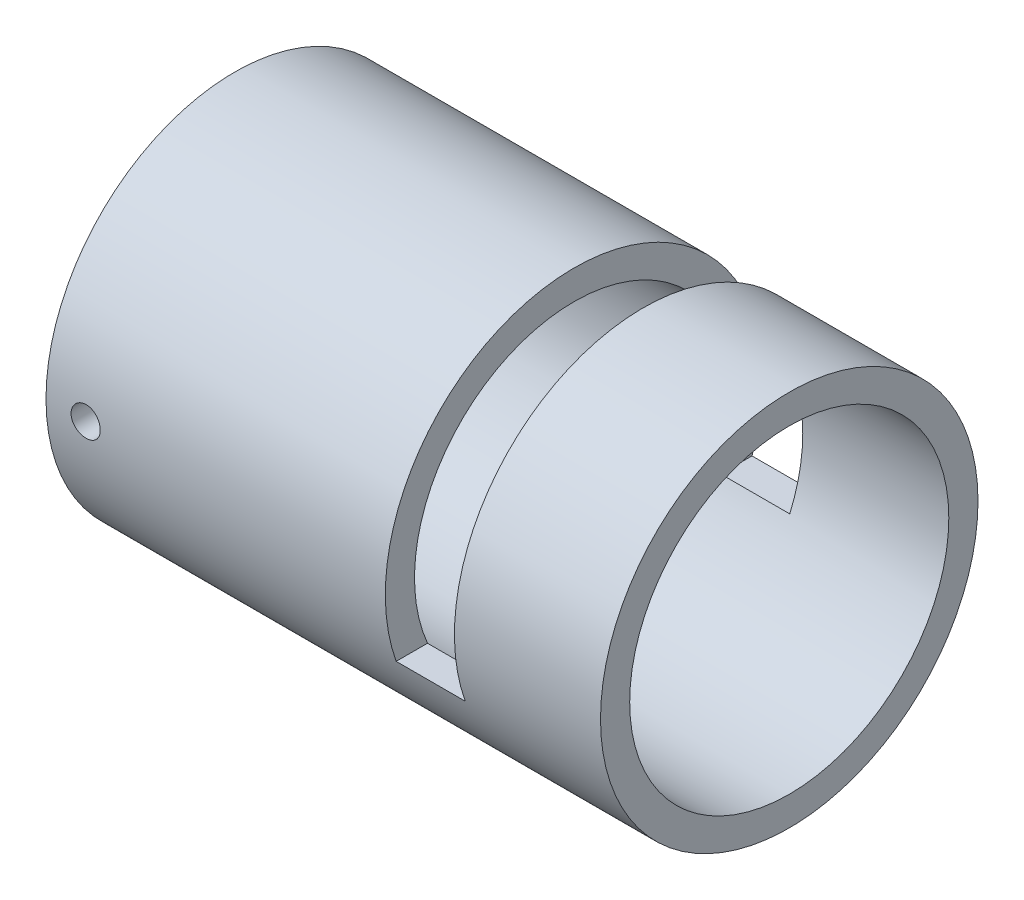
ISO-10303-21;
HEADER;
FILE_DESCRIPTION(('STEP AP214'),'2;1');
FILE_NAME('part.step','',(''),(''),'','','');
FILE_SCHEMA(('AUTOMOTIVE_DESIGN { 1 0 10303 214 1 1 1 1 }'));
ENDSEC;
DATA;
#1=APPLICATION_CONTEXT('core data for automotive mechanical design processes');
#2=APPLICATION_PROTOCOL_DEFINITION('international standard','automotive_design',2000,#1);
#3=PRODUCT_CONTEXT('',#1,'mechanical');
#4=PRODUCT('Part','Part','',(#3));
#5=PRODUCT_RELATED_PRODUCT_CATEGORY('part','',(#4));
#6=PRODUCT_DEFINITION_FORMATION('','',#4);
#7=PRODUCT_DEFINITION_CONTEXT('part definition',#1,'design');
#8=PRODUCT_DEFINITION('design','',#6,#7);
#9=PRODUCT_DEFINITION_SHAPE('','',#8);
#10=(LENGTH_UNIT() NAMED_UNIT(*) SI_UNIT(.MILLI.,.METRE.));
#11=(NAMED_UNIT(*) PLANE_ANGLE_UNIT() SI_UNIT($,.RADIAN.));
#12=(NAMED_UNIT(*) SI_UNIT($,.STERADIAN.) SOLID_ANGLE_UNIT());
#13=UNCERTAINTY_MEASURE_WITH_UNIT(LENGTH_MEASURE(1.E-05),#10,'distance_accuracy_value','');
#14=(GEOMETRIC_REPRESENTATION_CONTEXT(3) GLOBAL_UNCERTAINTY_ASSIGNED_CONTEXT((#13)) GLOBAL_UNIT_ASSIGNED_CONTEXT((#10,
#11,#12)) REPRESENTATION_CONTEXT('',''));
#15=CARTESIAN_POINT('',(0.,0.,0.));
#16=DIRECTION('',(0.,0.,1.));
#17=DIRECTION('',(1.,0.,0.));
#18=AXIS2_PLACEMENT_3D('',#15,#16,#17);
#19=CARTESIAN_POINT('',(-76.,0.,0.));
#20=DIRECTION('',(1.,0.,0.));
#21=DIRECTION('',(0.,0.,-1.));
#22=AXIS2_PLACEMENT_3D('',#19,#20,#21);
#23=CYLINDRICAL_SURFACE('',#22,25.8690409108859);
#24=CARTESIAN_POINT('',(0.,0.,0.));
#25=DIRECTION('',(1.,0.,0.));
#26=DIRECTION('',(0.,0.,-1.));
#27=AXIS2_PLACEMENT_3D('',#24,#25,#26);
#28=CIRCLE('',#27,25.8690409108859);
#29=CARTESIAN_POINT('',(0.,0.,-25.8690409108859));
#30=VERTEX_POINT('',#29);
#31=EDGE_CURVE('E93',#30,#30,#28,.T.);
#32=ORIENTED_EDGE('',*,*,#31,.F.);
#33=EDGE_LOOP('',(#32));
#34=FACE_BOUND('',#33,.T.);
#35=CARTESIAN_POINT('',(-76.,0.,0.));
#36=DIRECTION('',(1.,0.,0.));
#37=DIRECTION('',(0.,0.,-1.));
#38=AXIS2_PLACEMENT_3D('',#35,#36,#37);
#39=CIRCLE('',#38,25.8690409108859);
#40=CARTESIAN_POINT('',(-76.,0.,-25.8690409108859));
#41=VERTEX_POINT('',#40);
#42=EDGE_CURVE('E78',#41,#41,#39,.T.);
#43=ORIENTED_EDGE('',*,*,#42,.T.);
#44=EDGE_LOOP('',(#43));
#45=FACE_BOUND('',#44,.T.);
#46=CARTESIAN_POINT('',(-20.0182432156763,0.,0.));
#47=DIRECTION('',(1.,0.,0.));
#48=DIRECTION('',(0.,1.,0.));
#49=AXIS2_PLACEMENT_3D('',#46,#47,#48);
#50=CIRCLE('',#49,25.8690409108859);
#51=CARTESIAN_POINT('',(-20.0182432156763,-8.63877637101188,24.3839869681054));
#52=VERTEX_POINT('',#51);
#53=CARTESIAN_POINT('',(-20.0182432156763,-8.63877637101188,-24.3839869681054));
#54=VERTEX_POINT('',#53);
#55=EDGE_CURVE('E102',#52,#54,#50,.F.);
#56=ORIENTED_EDGE('',*,*,#55,.F.);
#57=DIRECTION('',(1.,0.,0.));
#58=VECTOR('',#57,1.);
#59=CARTESIAN_POINT('',(-76.,-8.63877637101188,24.3839869681054));
#60=LINE('',#59,#58);
#61=CARTESIAN_POINT('',(-29.4907377006783,-8.63877637101188,24.3839869681054));
#62=VERTEX_POINT('',#61);
#63=EDGE_CURVE('E107',#62,#52,#60,.T.);
#64=ORIENTED_EDGE('',*,*,#63,.F.);
#65=CARTESIAN_POINT('',(-29.4907377006783,0.,0.));
#66=DIRECTION('',(-1.,0.,0.));
#67=DIRECTION('',(0.,0.,1.));
#68=AXIS2_PLACEMENT_3D('',#65,#66,#67);
#69=CIRCLE('',#68,25.8690409108859);
#70=CARTESIAN_POINT('',(-29.4907377006783,-8.63877637101188,-24.3839869681054));
#71=VERTEX_POINT('',#70);
#72=EDGE_CURVE('E109',#71,#62,#69,.F.);
#73=ORIENTED_EDGE('',*,*,#72,.F.);
#74=DIRECTION('',(1.,0.,0.));
#75=VECTOR('',#74,1.);
#76=CARTESIAN_POINT('',(-76.,-8.63877637101188,-24.3839869681054));
#77=LINE('',#76,#75);
#78=EDGE_CURVE('E85',#54,#71,#77,.F.);
#79=ORIENTED_EDGE('',*,*,#78,.F.);
#80=EDGE_LOOP('',(#56,#64,#73,#79));
#81=FACE_BOUND('',#80,.T.);
#82=CARTESIAN_POINT('',(-72.5655206419493,0.,-25.8690409108859));
#83=CARTESIAN_POINT('',(-72.5655157309267,-0.1121611800042,-25.8690398931613));
#84=CARTESIAN_POINT('',(-72.5560538173916,-0.224399409221578,-25.8683036757847));
#85=CARTESIAN_POINT('',(-72.5184465726893,-0.445772452814454,-25.8654375416546));
#86=CARTESIAN_POINT('',(-72.4902798901789,-0.554903571812351,-25.8633060322261));
#87=CARTESIAN_POINT('',(-72.4160807328354,-0.766824046619074,-25.8578902677472));
#88=CARTESIAN_POINT('',(-72.3700581496239,-0.869616877170627,-25.8546066510251));
#89=CARTESIAN_POINT('',(-72.2614707882301,-1.06599315175739,-25.8472552536145));
#90=CARTESIAN_POINT('',(-72.1989096278436,-1.15957860376059,-25.8431876444762));
#91=CARTESIAN_POINT('',(-72.058870867979,-1.33511615635241,-25.8347148742354));
#92=CARTESIAN_POINT('',(-71.9813642537848,-1.41704508065181,-25.8303090667445));
#93=CARTESIAN_POINT('',(-71.8136956925462,-1.56674522133991,-25.8216619125487));
#94=CARTESIAN_POINT('',(-71.7235331986861,-1.63451582568261,-25.8174205729601));
#95=CARTESIAN_POINT('',(-71.5329740843417,-1.75405235353787,-25.8095754304018));
#96=CARTESIAN_POINT('',(-71.4325648184592,-1.80579817561972,-25.8059724305668));
#97=CARTESIAN_POINT('',(-71.2244506902607,-1.89168781694265,-25.7998189880917));
#98=CARTESIAN_POINT('',(-71.1167459407177,-1.92583190819954,-25.7972685291859));
#99=CARTESIAN_POINT('',(-70.897328368565,-1.97548232262893,-25.7935141538144));
#100=CARTESIAN_POINT('',(-70.785624062064,-1.99102607283211,-25.7923075336585));
#101=CARTESIAN_POINT('',(-70.5611858903497,-2.003150172866,-25.7913688256048));
#102=CARTESIAN_POINT('',(-70.4484520420462,-1.99973083359883,-25.7916367135323));
#103=CARTESIAN_POINT('',(-70.2254109032453,-1.97405678324625,-25.7936143044724));
#104=CARTESIAN_POINT('',(-70.1150989057892,-1.95184269055959,-25.7953208981883));
#105=CARTESIAN_POINT('',(-69.8997739681893,-1.88927278293266,-25.7999787184809));
#106=CARTESIAN_POINT('',(-69.7947610734718,-1.84891681250161,-25.8029299557251));
#107=CARTESIAN_POINT('',(-69.5928854849561,-1.75116302635236,-25.8097480965432));
#108=CARTESIAN_POINT('',(-69.4960316811968,-1.6937469226775,-25.8136159818313));
#109=CARTESIAN_POINT('',(-69.3133208048471,-1.5635159045951,-25.8218306559341));
#110=CARTESIAN_POINT('',(-69.2274639235175,-1.49070072242217,-25.8261774530756));
#111=CARTESIAN_POINT('',(-69.0689478324804,-1.33151038324341,-25.8348739786877));
#112=CARTESIAN_POINT('',(-68.9963238931217,-1.24510009939567,-25.83922368485));
#113=CARTESIAN_POINT('',(-68.8666077084133,-1.06129516248848,-25.8474249925234));
#114=CARTESIAN_POINT('',(-68.8095154716445,-0.9639005033605,-25.8512765937594));
#115=CARTESIAN_POINT('',(-68.7124857762371,-0.760869051817435,-25.8580482962047));
#116=CARTESIAN_POINT('',(-68.6725498077263,-0.655231544401361,-25.8609683164947));
#117=CARTESIAN_POINT('',(-68.6109906163078,-0.438723268815589,-25.8655468712195));
#118=CARTESIAN_POINT('',(-68.5893670662982,-0.327852594159693,-25.8672054281868));
#119=CARTESIAN_POINT('',(-68.5650905809609,-0.104331005835406,-25.8690712838992));
#120=CARTESIAN_POINT('',(-68.5623889131664,0.00831458527016643,-25.8692823106651));
#121=CARTESIAN_POINT('',(-68.5759053261401,0.232457169518035,-25.8682392724035));
#122=CARTESIAN_POINT('',(-68.5921232553403,0.343954171854649,-25.8669852191131));
#123=CARTESIAN_POINT('',(-68.6429781166276,0.562496169040388,-25.863155495715));
#124=CARTESIAN_POINT('',(-68.6775925334809,0.669546433895366,-25.8605814412754));
#125=CARTESIAN_POINT('',(-68.7642348398479,0.876319253048502,-25.8544010094354));
#126=CARTESIAN_POINT('',(-68.8162629673493,0.976041707177065,-25.8507946179266));
#127=CARTESIAN_POINT('',(-68.9363787797521,1.16555036918215,-25.8429447908862));
#128=CARTESIAN_POINT('',(-69.0044988329215,1.25531600742811,-25.8387000777328));
#129=CARTESIAN_POINT('',(-69.1548179487456,1.42215546447356,-25.8300550565032));
#130=CARTESIAN_POINT('',(-69.2370172220298,1.49922909336286,-25.8256547461001));
#131=CARTESIAN_POINT('',(-69.4133725285744,1.63866319704776,-25.8171835052501));
#132=CARTESIAN_POINT('',(-69.5075536980804,1.70099192965493,-25.8131132975845));
#133=CARTESIAN_POINT('',(-69.7050738437384,1.80894948213598,-25.8057729931572));
#134=CARTESIAN_POINT('',(-69.8084127394337,1.85457844871012,-25.802502889367));
#135=CARTESIAN_POINT('',(-70.0212014048842,1.92778687153344,-25.7971368686899));
#136=CARTESIAN_POINT('',(-70.1306443963118,1.95538593251642,-25.795039676801));
#137=CARTESIAN_POINT('',(-70.3526278060323,1.99181500194299,-25.792252512275));
#138=CARTESIAN_POINT('',(-70.4651681740101,2.00064531509223,-25.7915625167925));
#139=CARTESIAN_POINT('',(-70.6898362505237,1.9992829159535,-25.7916681376176));
#140=CARTESIAN_POINT('',(-70.8019642667571,1.9891400846402,-25.7924598584505));
#141=CARTESIAN_POINT('',(-71.022919497551,1.95022313958523,-25.7954314340034));
#142=CARTESIAN_POINT('',(-71.1317467067353,1.92144899549917,-25.797611290984));
#143=CARTESIAN_POINT('',(-71.3430156205925,1.8460984504445,-25.8031125105256));
#144=CARTESIAN_POINT('',(-71.4454575760609,1.79952274918566,-25.8064338282196));
#145=CARTESIAN_POINT('',(-71.6410758146042,1.68989706224039,-25.8138437765817));
#146=CARTESIAN_POINT('',(-71.734252273006,1.6268473883655,-25.8179323927263));
#147=CARTESIAN_POINT('',(-71.9089494368753,1.48587651122678,-25.8264289692107));
#148=CARTESIAN_POINT('',(-71.9904404388503,1.40791854510715,-25.8308377019073));
#149=CARTESIAN_POINT('',(-72.1392116020766,1.23940718620378,-25.8394707649629));
#150=CARTESIAN_POINT('',(-72.2064883081634,1.14885073987416,-25.8436950502895));
#151=CARTESIAN_POINT('',(-72.3249981501013,0.957561534118862,-25.8514898118666));
#152=CARTESIAN_POINT('',(-72.3762044758339,0.856812136162174,-25.8550591914654));
#153=CARTESIAN_POINT('',(-72.4609093943546,0.648188207251334,-25.8611286482198));
#154=CARTESIAN_POINT('',(-72.4944284644273,0.540322079202815,-25.863629961278));
#155=CARTESIAN_POINT('',(-72.5342147777892,0.359843279304291,-25.8666350613494));
#156=CARTESIAN_POINT('',(-72.5459390087628,0.288393277183435,-25.867533178977));
#157=CARTESIAN_POINT('',(-72.5615935157776,0.14463953115799,-25.8687364312631));
#158=CARTESIAN_POINT('',(-72.5655238092011,0.0723357891578036,-25.8690415672441));
#159=CARTESIAN_POINT('',(-72.5655206419493,0.,-25.8690409108859));
#160=B_SPLINE_CURVE_WITH_KNOTS('',3,(#82,#83,#84,#85,#86,#87,#88,#89,#90,#91,#92,#93,#94,#95,
#96,#97,#98,#99,#100,#101,#102,#103,#104,#105,#106,#107,#108,#109,#110,#111,#112,#113,#114,#115,
#116,#117,#118,#119,#120,#121,#122,#123,#124,#125,#126,#127,#128,#129,#130,#131,#132,#133,#134,
#135,#136,#137,#138,#139,#140,#141,#142,#143,#144,#145,#146,#147,#148,#149,#150,#151,#152,#153,
#154,#155,#156,#157,#158,#159),.UNSPECIFIED.,.T.,.F.,(4,2,2,2,2,2,2,2,2,2,2,2,2,2,2,2,2,2,2,2,2,
2,2,2,2,2,2,2,2,2,2,2,2,2,2,2,2,2,4),(0.,0.336219446995308,0.672823347008522,1.00924104441277,
1.34558521162153,1.6825890451,2.01960744380845,2.3570469006469,2.69448114256529,
3.03123526186383,3.36798386005459,3.70400654540794,4.04003211080638,4.37641919322456,
4.71281212535817,5.05008894795198,5.38736595688176,5.72467225447967,6.06197252688099,
6.39840377691464,6.73483233176021,7.07085008085787,7.40687242239164,7.74357650274117,
8.0802856207269,8.41771312661373,8.7551376682738,9.0921946995415,9.42924625873608,
9.76541294428305,10.1015801773382,10.4377341983295,10.773881857218,11.1108693793547,
11.4479387213118,11.7855674409846,12.1228044111874,12.3396419415057,12.5564789882245),.UNSPECIFIED.);
#161=CARTESIAN_POINT('',(-72.5655206419493,0.,-25.8690409108859));
#162=VERTEX_POINT('',#161);
#163=EDGE_CURVE('E112',#162,#162,#160,.T.);
#164=ORIENTED_EDGE('',*,*,#163,.T.);
#165=EDGE_LOOP('',(#164));
#166=FACE_BOUND('',#165,.T.);
#167=CARTESIAN_POINT('',(-72.5655206419493,0.,25.8690409108859));
#168=CARTESIAN_POINT('',(-72.5655157309267,-0.1121611800042,25.8690398931613));
#169=CARTESIAN_POINT('',(-72.5560538173916,-0.224399409221578,25.8683036757847));
#170=CARTESIAN_POINT('',(-72.5184465726893,-0.445772452814454,25.8654375416546));
#171=CARTESIAN_POINT('',(-72.4902798901789,-0.554903571812351,25.8633060322261));
#172=CARTESIAN_POINT('',(-72.4160807328354,-0.766824046619074,25.8578902677472));
#173=CARTESIAN_POINT('',(-72.3700581496239,-0.869616877170627,25.8546066510251));
#174=CARTESIAN_POINT('',(-72.2614707882301,-1.06599315175739,25.8472552536145));
#175=CARTESIAN_POINT('',(-72.1989096278436,-1.15957860376059,25.8431876444762));
#176=CARTESIAN_POINT('',(-72.058870867979,-1.33511615635241,25.8347148742354));
#177=CARTESIAN_POINT('',(-71.9813642537848,-1.41704508065181,25.8303090667445));
#178=CARTESIAN_POINT('',(-71.8136956925462,-1.56674522133991,25.8216619125487));
#179=CARTESIAN_POINT('',(-71.7235331986861,-1.63451582568261,25.8174205729601));
#180=CARTESIAN_POINT('',(-71.5329740843417,-1.75405235353787,25.8095754304018));
#181=CARTESIAN_POINT('',(-71.4325648184592,-1.80579817561972,25.8059724305668));
#182=CARTESIAN_POINT('',(-71.2244506902607,-1.89168781694265,25.7998189880917));
#183=CARTESIAN_POINT('',(-71.1167459407177,-1.92583190819954,25.7972685291859));
#184=CARTESIAN_POINT('',(-70.897328368565,-1.97548232262893,25.7935141538144));
#185=CARTESIAN_POINT('',(-70.785624062064,-1.99102607283211,25.7923075336585));
#186=CARTESIAN_POINT('',(-70.5611858903497,-2.003150172866,25.7913688256048));
#187=CARTESIAN_POINT('',(-70.4484520420462,-1.99973083359883,25.7916367135323));
#188=CARTESIAN_POINT('',(-70.2254109032453,-1.97405678324625,25.7936143044724));
#189=CARTESIAN_POINT('',(-70.1150989057892,-1.95184269055959,25.7953208981883));
#190=CARTESIAN_POINT('',(-69.8997739681893,-1.88927278293266,25.7999787184809));
#191=CARTESIAN_POINT('',(-69.7947610734718,-1.84891681250161,25.8029299557251));
#192=CARTESIAN_POINT('',(-69.5928854849561,-1.75116302635236,25.8097480965432));
#193=CARTESIAN_POINT('',(-69.4960316811968,-1.6937469226775,25.8136159818313));
#194=CARTESIAN_POINT('',(-69.3133208048471,-1.5635159045951,25.8218306559341));
#195=CARTESIAN_POINT('',(-69.2274639235175,-1.49070072242217,25.8261774530756));
#196=CARTESIAN_POINT('',(-69.0689478324804,-1.33151038324341,25.8348739786877));
#197=CARTESIAN_POINT('',(-68.9963238931217,-1.24510009939567,25.83922368485));
#198=CARTESIAN_POINT('',(-68.8666077084133,-1.06129516248848,25.8474249925234));
#199=CARTESIAN_POINT('',(-68.8095154716445,-0.9639005033605,25.8512765937594));
#200=CARTESIAN_POINT('',(-68.7124857762371,-0.760869051817435,25.8580482962047));
#201=CARTESIAN_POINT('',(-68.6725498077263,-0.655231544401361,25.8609683164947));
#202=CARTESIAN_POINT('',(-68.6109906163078,-0.438723268815589,25.8655468712195));
#203=CARTESIAN_POINT('',(-68.5893670662982,-0.327852594159693,25.8672054281868));
#204=CARTESIAN_POINT('',(-68.5650905809609,-0.104331005835406,25.8690712838992));
#205=CARTESIAN_POINT('',(-68.5623889131664,0.00831458527016643,25.8692823106651));
#206=CARTESIAN_POINT('',(-68.5759053261401,0.232457169518035,25.8682392724035));
#207=CARTESIAN_POINT('',(-68.5921232553403,0.343954171854649,25.8669852191131));
#208=CARTESIAN_POINT('',(-68.6429781166276,0.562496169040388,25.863155495715));
#209=CARTESIAN_POINT('',(-68.6775925334809,0.669546433895366,25.8605814412754));
#210=CARTESIAN_POINT('',(-68.7642348398479,0.876319253048502,25.8544010094354));
#211=CARTESIAN_POINT('',(-68.8162629673493,0.976041707177065,25.8507946179266));
#212=CARTESIAN_POINT('',(-68.9363787797521,1.16555036918215,25.8429447908862));
#213=CARTESIAN_POINT('',(-69.0044988329215,1.25531600742811,25.8387000777328));
#214=CARTESIAN_POINT('',(-69.1548179487456,1.42215546447356,25.8300550565032));
#215=CARTESIAN_POINT('',(-69.2370172220298,1.49922909336286,25.8256547461001));
#216=CARTESIAN_POINT('',(-69.4133725285744,1.63866319704776,25.8171835052501));
#217=CARTESIAN_POINT('',(-69.5075536980804,1.70099192965493,25.8131132975845));
#218=CARTESIAN_POINT('',(-69.7050738437384,1.80894948213598,25.8057729931572));
#219=CARTESIAN_POINT('',(-69.8084127394337,1.85457844871012,25.802502889367));
#220=CARTESIAN_POINT('',(-70.0212014048842,1.92778687153344,25.7971368686899));
#221=CARTESIAN_POINT('',(-70.1306443963118,1.95538593251642,25.795039676801));
#222=CARTESIAN_POINT('',(-70.3526278060323,1.99181500194299,25.792252512275));
#223=CARTESIAN_POINT('',(-70.4651681740101,2.00064531509223,25.7915625167925));
#224=CARTESIAN_POINT('',(-70.6898362505237,1.9992829159535,25.7916681376176));
#225=CARTESIAN_POINT('',(-70.8019642667571,1.9891400846402,25.7924598584505));
#226=CARTESIAN_POINT('',(-71.022919497551,1.95022313958523,25.7954314340034));
#227=CARTESIAN_POINT('',(-71.1317467067353,1.92144899549917,25.797611290984));
#228=CARTESIAN_POINT('',(-71.3430156205925,1.8460984504445,25.8031125105256));
#229=CARTESIAN_POINT('',(-71.4454575760609,1.79952274918566,25.8064338282196));
#230=CARTESIAN_POINT('',(-71.6410758146042,1.68989706224039,25.8138437765817));
#231=CARTESIAN_POINT('',(-71.734252273006,1.6268473883655,25.8179323927263));
#232=CARTESIAN_POINT('',(-71.9089494368753,1.48587651122678,25.8264289692107));
#233=CARTESIAN_POINT('',(-71.9904404388503,1.40791854510715,25.8308377019073));
#234=CARTESIAN_POINT('',(-72.1392116020766,1.23940718620378,25.8394707649629));
#235=CARTESIAN_POINT('',(-72.2064883081634,1.14885073987416,25.8436950502895));
#236=CARTESIAN_POINT('',(-72.3249981501013,0.957561534118862,25.8514898118666));
#237=CARTESIAN_POINT('',(-72.3762044758339,0.856812136162174,25.8550591914654));
#238=CARTESIAN_POINT('',(-72.4609093943546,0.648188207251334,25.8611286482198));
#239=CARTESIAN_POINT('',(-72.4944284644273,0.540322079202815,25.863629961278));
#240=CARTESIAN_POINT('',(-72.5342147777892,0.359843279304291,25.8666350613494));
#241=CARTESIAN_POINT('',(-72.5459390087628,0.288393277183435,25.867533178977));
#242=CARTESIAN_POINT('',(-72.5615935157776,0.14463953115799,25.8687364312631));
#243=CARTESIAN_POINT('',(-72.5655238092011,0.0723357891578036,25.8690415672441));
#244=CARTESIAN_POINT('',(-72.5655206419493,0.,25.8690409108859));
#245=B_SPLINE_CURVE_WITH_KNOTS('',3,(#167,#168,#169,#170,#171,#172,#173,#174,#175,#176,#177,
#178,#179,#180,#181,#182,#183,#184,#185,#186,#187,#188,#189,#190,#191,#192,#193,#194,#195,#196,
#197,#198,#199,#200,#201,#202,#203,#204,#205,#206,#207,#208,#209,#210,#211,#212,#213,#214,#215,
#216,#217,#218,#219,#220,#221,#222,#223,#224,#225,#226,#227,#228,#229,#230,#231,#232,#233,#234,
#235,#236,#237,#238,#239,#240,#241,#242,#243,#244),.UNSPECIFIED.,.T.,.F.,(4,2,2,2,2,2,2,2,2,2,2,
2,2,2,2,2,2,2,2,2,2,2,2,2,2,2,2,2,2,2,2,2,2,2,2,2,2,2,4),(0.,0.336219446995308,
0.672823347008522,1.00924104441277,1.34558521162153,1.6825890451,2.01960744380845,
2.3570469006469,2.69448114256529,3.03123526186383,3.36798386005459,3.70400654540794,
4.04003211080638,4.37641919322456,4.71281212535817,5.05008894795198,5.38736595688176,
5.72467225447967,6.06197252688099,6.39840377691464,6.73483233176021,7.07085008085787,
7.40687242239164,7.74357650274117,8.0802856207269,8.41771312661373,8.7551376682738,
9.0921946995415,9.42924625873608,9.76541294428305,10.1015801773382,10.4377341983295,
10.773881857218,11.1108693793547,11.4479387213118,11.7855674409846,12.1228044111874,
12.3396419415057,12.5564789882245),.UNSPECIFIED.);
#246=CARTESIAN_POINT('',(-72.5655206419493,0.,25.8690409108859));
#247=VERTEX_POINT('',#246);
#248=EDGE_CURVE('E167',#247,#247,#245,.T.);
#249=ORIENTED_EDGE('',*,*,#248,.F.);
#250=EDGE_LOOP('',(#249));
#251=FACE_BOUND('',#250,.T.);
#252=ADVANCED_FACE('F35',(#34,#45,#81,#166,#251),#23,.T.);
#253=CARTESIAN_POINT('',(-76.,0.,0.));
#254=DIRECTION('',(1.,0.,0.));
#255=DIRECTION('',(0.,0.,-1.));
#256=AXIS2_PLACEMENT_3D('',#253,#254,#255);
#257=CYLINDRICAL_SURFACE('',#256,21.8690409108858);
#258=CARTESIAN_POINT('',(0.,0.,0.));
#259=DIRECTION('',(1.,0.,0.));
#260=DIRECTION('',(0.,0.,-1.));
#261=AXIS2_PLACEMENT_3D('',#258,#259,#260);
#262=CIRCLE('',#261,21.8690409108858);
#263=CARTESIAN_POINT('',(0.,0.,-21.8690409108858));
#264=VERTEX_POINT('',#263);
#265=EDGE_CURVE('E99',#264,#264,#262,.T.);
#266=ORIENTED_EDGE('',*,*,#265,.T.);
#267=EDGE_LOOP('',(#266));
#268=FACE_BOUND('',#267,.T.);
#269=CARTESIAN_POINT('',(-76.,0.,0.));
#270=DIRECTION('',(1.,0.,0.));
#271=DIRECTION('',(0.,0.,-1.));
#272=AXIS2_PLACEMENT_3D('',#269,#270,#271);
#273=CIRCLE('',#272,21.8690409108858);
#274=CARTESIAN_POINT('',(-76.,0.,-21.8690409108858));
#275=VERTEX_POINT('',#274);
#276=EDGE_CURVE('E96',#275,#275,#273,.T.);
#277=ORIENTED_EDGE('',*,*,#276,.F.);
#278=EDGE_LOOP('',(#277));
#279=FACE_BOUND('',#278,.T.);
#280=DIRECTION('',(1.,0.,0.));
#281=VECTOR('',#280,1.);
#282=CARTESIAN_POINT('',(-76.,-8.63877637101188,20.0904577641636));
#283=LINE('',#282,#281);
#284=CARTESIAN_POINT('',(-29.4907377006783,-8.63877637101188,20.0904577641636));
#285=VERTEX_POINT('',#284);
#286=CARTESIAN_POINT('',(-20.0182432156763,-8.63877637101188,20.0904577641636));
#287=VERTEX_POINT('',#286);
#288=EDGE_CURVE('E77',#285,#287,#283,.T.);
#289=ORIENTED_EDGE('',*,*,#288,.T.);
#290=CARTESIAN_POINT('',(-20.0182432156763,0.,0.));
#291=DIRECTION('',(1.,0.,0.));
#292=DIRECTION('',(0.,1.,0.));
#293=AXIS2_PLACEMENT_3D('',#290,#291,#292);
#294=CIRCLE('',#293,21.8690409108858);
#295=CARTESIAN_POINT('',(-20.0182432156763,-8.63877637101188,-20.0904577641636));
#296=VERTEX_POINT('',#295);
#297=EDGE_CURVE('E11',#287,#296,#294,.F.);
#298=ORIENTED_EDGE('',*,*,#297,.T.);
#299=DIRECTION('',(1.,0.,0.));
#300=VECTOR('',#299,1.);
#301=CARTESIAN_POINT('',(-76.,-8.63877637101188,-20.0904577641636));
#302=LINE('',#301,#300);
#303=CARTESIAN_POINT('',(-29.4907377006783,-8.63877637101188,-20.0904577641636));
#304=VERTEX_POINT('',#303);
#305=EDGE_CURVE('E42',#296,#304,#302,.F.);
#306=ORIENTED_EDGE('',*,*,#305,.T.);
#307=CARTESIAN_POINT('',(-29.4907377006783,0.,0.));
#308=DIRECTION('',(-1.,0.,0.));
#309=DIRECTION('',(0.,0.,1.));
#310=AXIS2_PLACEMENT_3D('',#307,#308,#309);
#311=CIRCLE('',#310,21.8690409108858);
#312=EDGE_CURVE('E72',#304,#285,#311,.F.);
#313=ORIENTED_EDGE('',*,*,#312,.T.);
#314=EDGE_LOOP('',(#289,#298,#306,#313));
#315=FACE_BOUND('',#314,.T.);
#316=CARTESIAN_POINT('',(-72.5655206419493,0.,-21.8690409108858));
#317=CARTESIAN_POINT('',(-72.5655157649086,-0.112089664463379,-21.869039721322));
#318=CARTESIAN_POINT('',(-72.5560658621158,-0.224254614490244,-21.8681699652575));
#319=CARTESIAN_POINT('',(-72.5185091127663,-0.445478222682079,-21.8647839648556));
#320=CARTESIAN_POINT('',(-72.4903813996331,-0.554533264225601,-21.8622658790732));
#321=CARTESIAN_POINT('',(-72.4162917805144,-0.766301242493291,-21.8558676315796));
#322=CARTESIAN_POINT('',(-72.3703402821652,-0.869017839855912,-21.8519882648713));
#323=CARTESIAN_POINT('',(-72.2619268575041,-1.0652565735644,-21.8433019153768));
#324=CARTESIAN_POINT('',(-72.1994683471293,-1.15878060671906,-21.8384951245661));
#325=CARTESIAN_POINT('',(-72.0596096868589,-1.33428701718917,-21.8284765519698));
#326=CARTESIAN_POINT('',(-71.982169696964,-1.41623758909741,-21.8232637129727));
#327=CARTESIAN_POINT('',(-71.8146309269464,-1.56599767009884,-21.8130293734237));
#328=CARTESIAN_POINT('',(-71.7245315776126,-1.63380654298848,-21.8080078814884));
#329=CARTESIAN_POINT('',(-71.5340357877753,-1.75346858754936,-21.7987137184883));
#330=CARTESIAN_POINT('',(-71.4336214535494,-1.80529338610909,-21.7944423847382));
#331=CARTESIAN_POINT('',(-71.2254704938613,-1.89133496547931,-21.7871447856867));
#332=CARTESIAN_POINT('',(-71.1177340216594,-1.92555211470838,-21.7841184943346));
#333=CARTESIAN_POINT('',(-70.8983186787897,-1.97531380112811,-21.7796628672773));
#334=CARTESIAN_POINT('',(-70.7866517625371,-1.99091064209615,-21.7782290591384));
#335=CARTESIAN_POINT('',(-70.5622765732804,-2.00315060338176,-21.7771067361357));
#336=CARTESIAN_POINT('',(-70.4495683235071,-1.9997941455095,-21.777418182431));
#337=CARTESIAN_POINT('',(-70.226669254158,-1.97426595735939,-21.7797471038175));
#338=CARTESIAN_POINT('',(-70.1164718488442,-1.95215119310803,-21.7817594135885));
#339=CARTESIAN_POINT('',(-69.9013594409365,-1.88982271479477,-21.7872552408358));
#340=CARTESIAN_POINT('',(-69.7964444991667,-1.84960879238592,-21.7907387752479));
#341=CARTESIAN_POINT('',(-69.5946943636657,-1.75216016106892,-21.7987904929522));
#342=CARTESIAN_POINT('',(-69.4978715182824,-1.69490002622536,-21.8033602944415));
#343=CARTESIAN_POINT('',(-69.3151890984884,-1.56500267582784,-21.8130682139956));
#344=CARTESIAN_POINT('',(-69.2293297921687,-1.49236508436499,-21.8182063459522));
#345=CARTESIAN_POINT('',(-69.0706805464113,-1.33345585017335,-21.8284949895234));
#346=CARTESIAN_POINT('',(-68.9979399013269,-1.24713498307861,-21.8336454770451));
#347=CARTESIAN_POINT('',(-68.8679743856669,-1.0634808859233,-21.8433605531265));
#348=CARTESIAN_POINT('',(-68.8107495284658,-0.966147646370247,-21.8479251411813));
#349=CARTESIAN_POINT('',(-68.7134425535674,-0.763198714287574,-21.8559552655945));
#350=CARTESIAN_POINT('',(-68.6733627667695,-0.657581897900823,-21.8594206524982));
#351=CARTESIAN_POINT('',(-68.6115189126066,-0.441079240292024,-21.8648603038929));
#352=CARTESIAN_POINT('',(-68.5897543873276,-0.330193530874899,-21.8668346056634));
#353=CARTESIAN_POINT('',(-68.5652210149811,-0.106727821081864,-21.8690648518853));
#354=CARTESIAN_POINT('',(-68.5623841102553,0.00584464868359379,-21.8693269527913));
#355=CARTESIAN_POINT('',(-68.5756080052111,0.229863515128803,-21.8681197389114));
#356=CARTESIAN_POINT('',(-68.5916685919895,0.341309924480724,-21.8666504436318));
#357=CARTESIAN_POINT('',(-68.642175135289,0.55971795531955,-21.8621495652602));
#358=CARTESIAN_POINT('',(-68.6765893970742,0.666686966362136,-21.8591206757227));
#359=CARTESIAN_POINT('',(-68.762793931265,0.873333013760601,-21.851840648777));
#360=CARTESIAN_POINT('',(-68.8145845322677,0.973009912174755,-21.8475894882551));
#361=CARTESIAN_POINT('',(-68.9342415851672,1.16255106036907,-21.8383256438146));
#362=CARTESIAN_POINT('',(-69.0021529512759,1.25238685095491,-21.8333108465726));
#363=CARTESIAN_POINT('',(-69.1520591238424,1.41940802548548,-21.82308975625));
#364=CARTESIAN_POINT('',(-69.2340542252608,1.49659314441654,-21.8178834591606));
#365=CARTESIAN_POINT('',(-69.4100964189272,1.63635675249151,-21.8078477842621));
#366=CARTESIAN_POINT('',(-69.5041789416335,1.69889071086054,-21.8030195845069));
#367=CARTESIAN_POINT('',(-69.7015497116617,1.80727118991491,-21.7943040740356));
#368=CARTESIAN_POINT('',(-69.8048378510969,1.85311790613709,-21.7904167522948));
#369=CARTESIAN_POINT('',(-70.0175325142762,1.9267472311541,-21.7840301284849));
#370=CARTESIAN_POINT('',(-70.126929659911,1.95455674408282,-21.7815287599562));
#371=CARTESIAN_POINT('',(-70.3488645414361,1.99140971051856,-21.7781905941658));
#372=CARTESIAN_POINT('',(-70.4614022031853,2.00045360666375,-21.7773537576416));
#373=CARTESIAN_POINT('',(-70.6859810262583,1.99951303187141,-21.7774401041594));
#374=CARTESIAN_POINT('',(-70.798022489677,1.98959851975627,-21.7783568163985));
#375=CARTESIAN_POINT('',(-71.0188415039918,1.95116881805554,-21.7818331998998));
#376=CARTESIAN_POINT('',(-71.1276190504716,1.92265360330361,-21.7843928733849));
#377=CARTESIAN_POINT('',(-71.338824583727,1.8478504164305,-21.7908650247273));
#378=CARTESIAN_POINT('',(-71.4412531550991,1.80156408345768,-21.7947773778146));
#379=CARTESIAN_POINT('',(-71.6368978556288,1.69254005232334,-21.8035143061078));
#380=CARTESIAN_POINT('',(-71.730114085969,1.62980253487883,-21.8083388712927));
#381=CARTESIAN_POINT('',(-71.9050464360699,1.48939399641702,-21.8183778790036));
#382=CARTESIAN_POINT('',(-71.9867207436404,1.41167097606275,-21.8235936392946));
#383=CARTESIAN_POINT('',(-72.1359008481038,1.24359685629808,-21.8338152872476));
#384=CARTESIAN_POINT('',(-72.2034032284269,1.15324272050281,-21.8388211240689));
#385=CARTESIAN_POINT('',(-72.3224335697798,0.962262773789777,-21.8480697926132));
#386=CARTESIAN_POINT('',(-72.3739266647854,0.861615169460507,-21.8523109506547));
#387=CARTESIAN_POINT('',(-72.4592149265125,0.653130142938694,-21.8595335333265));
#388=CARTESIAN_POINT('',(-72.4930302563399,0.545301070894021,-21.8625163924084));
#389=CARTESIAN_POINT('',(-72.5334744963509,0.364039683630105,-21.8661280735963));
#390=CARTESIAN_POINT('',(-72.5454756216245,0.291769941063505,-21.8672153589119));
#391=CARTESIAN_POINT('',(-72.5615002734233,0.14634416264312,-21.8686721647262));
#392=CARTESIAN_POINT('',(-72.5655238263775,0.0731881297263398,-21.8690416876028));
#393=CARTESIAN_POINT('',(-72.5655206419493,0.,-21.8690409108858));
#394=B_SPLINE_CURVE_WITH_KNOTS('',3,(#316,#317,#318,#319,#320,#321,#322,#323,#324,#325,#326,
#327,#328,#329,#330,#331,#332,#333,#334,#335,#336,#337,#338,#339,#340,#341,#342,#343,#344,#345,
#346,#347,#348,#349,#350,#351,#352,#353,#354,#355,#356,#357,#358,#359,#360,#361,#362,#363,#364,
#365,#366,#367,#368,#369,#370,#371,#372,#373,#374,#375,#376,#377,#378,#379,#380,#381,#382,#383,
#384,#385,#386,#387,#388,#389,#390,#391,#392,#393),.UNSPECIFIED.,.T.,.F.,(4,2,2,2,2,2,2,2,2,2,2,
2,2,2,2,2,2,2,2,2,2,2,2,2,2,2,2,2,2,2,2,2,2,2,2,2,2,2,4),(0.,0.336001758775398,
0.672379526765317,1.00856117255511,1.34467330380241,1.68169185372624,2.01872556209549,
2.35635413618712,2.69397564552552,3.0306465398696,3.36730994155235,3.70295459480914,
4.03860311191025,4.37475480858411,4.71091472358749,5.04831259871354,5.38571076467357,
5.72315478588057,6.0605903701367,6.39681198720241,6.73302981635988,7.06866890622881,
7.40431434359567,7.74090613463185,8.07750497588887,8.41511397594637,8.75271901986078,
9.08981932988754,9.42691168839509,9.76276253535052,10.0986138367058,10.4344341677021,
10.7702508098513,11.107254410499,11.4443391629565,11.7821529787751,12.1195806417561,
12.3389712688624,12.5583611691468),.UNSPECIFIED.);
#395=CARTESIAN_POINT('',(-72.5655206419493,0.,-21.8690409108858));
#396=VERTEX_POINT('',#395);
#397=EDGE_CURVE('E121',#396,#396,#394,.T.);
#398=ORIENTED_EDGE('',*,*,#397,.F.);
#399=EDGE_LOOP('',(#398));
#400=FACE_BOUND('',#399,.T.);
#401=CARTESIAN_POINT('',(-72.5655206419493,0.,21.8690409108858));
#402=CARTESIAN_POINT('',(-72.5655157649086,-0.112089664463379,21.869039721322));
#403=CARTESIAN_POINT('',(-72.5560658621158,-0.224254614490244,21.8681699652575));
#404=CARTESIAN_POINT('',(-72.5185091127663,-0.445478222682079,21.8647839648556));
#405=CARTESIAN_POINT('',(-72.4903813996331,-0.554533264225601,21.8622658790732));
#406=CARTESIAN_POINT('',(-72.4162917805144,-0.766301242493291,21.8558676315796));
#407=CARTESIAN_POINT('',(-72.3703402821652,-0.869017839855912,21.8519882648713));
#408=CARTESIAN_POINT('',(-72.2619268575041,-1.0652565735644,21.8433019153768));
#409=CARTESIAN_POINT('',(-72.1994683471293,-1.15878060671906,21.8384951245661));
#410=CARTESIAN_POINT('',(-72.0596096868589,-1.33428701718917,21.8284765519698));
#411=CARTESIAN_POINT('',(-71.982169696964,-1.41623758909741,21.8232637129727));
#412=CARTESIAN_POINT('',(-71.8146309269464,-1.56599767009884,21.8130293734237));
#413=CARTESIAN_POINT('',(-71.7245315776126,-1.63380654298848,21.8080078814884));
#414=CARTESIAN_POINT('',(-71.5340357877753,-1.75346858754936,21.7987137184883));
#415=CARTESIAN_POINT('',(-71.4336214535494,-1.80529338610909,21.7944423847382));
#416=CARTESIAN_POINT('',(-71.2254704938613,-1.89133496547931,21.7871447856867));
#417=CARTESIAN_POINT('',(-71.1177340216594,-1.92555211470838,21.7841184943346));
#418=CARTESIAN_POINT('',(-70.8983186787897,-1.97531380112811,21.7796628672773));
#419=CARTESIAN_POINT('',(-70.7866517625371,-1.99091064209615,21.7782290591384));
#420=CARTESIAN_POINT('',(-70.5622765732804,-2.00315060338176,21.7771067361357));
#421=CARTESIAN_POINT('',(-70.4495683235071,-1.9997941455095,21.777418182431));
#422=CARTESIAN_POINT('',(-70.226669254158,-1.97426595735939,21.7797471038175));
#423=CARTESIAN_POINT('',(-70.1164718488442,-1.95215119310803,21.7817594135885));
#424=CARTESIAN_POINT('',(-69.9013594409365,-1.88982271479477,21.7872552408358));
#425=CARTESIAN_POINT('',(-69.7964444991667,-1.84960879238592,21.7907387752479));
#426=CARTESIAN_POINT('',(-69.5946943636657,-1.75216016106892,21.7987904929522));
#427=CARTESIAN_POINT('',(-69.4978715182824,-1.69490002622536,21.8033602944415));
#428=CARTESIAN_POINT('',(-69.3151890984884,-1.56500267582784,21.8130682139956));
#429=CARTESIAN_POINT('',(-69.2293297921687,-1.49236508436499,21.8182063459522));
#430=CARTESIAN_POINT('',(-69.0706805464113,-1.33345585017335,21.8284949895234));
#431=CARTESIAN_POINT('',(-68.9979399013269,-1.24713498307861,21.8336454770451));
#432=CARTESIAN_POINT('',(-68.8679743856669,-1.0634808859233,21.8433605531265));
#433=CARTESIAN_POINT('',(-68.8107495284658,-0.966147646370247,21.8479251411813));
#434=CARTESIAN_POINT('',(-68.7134425535674,-0.763198714287574,21.8559552655945));
#435=CARTESIAN_POINT('',(-68.6733627667695,-0.657581897900823,21.8594206524982));
#436=CARTESIAN_POINT('',(-68.6115189126066,-0.441079240292024,21.8648603038929));
#437=CARTESIAN_POINT('',(-68.5897543873276,-0.330193530874899,21.8668346056634));
#438=CARTESIAN_POINT('',(-68.5652210149811,-0.106727821081864,21.8690648518853));
#439=CARTESIAN_POINT('',(-68.5623841102553,0.00584464868359379,21.8693269527913));
#440=CARTESIAN_POINT('',(-68.5756080052111,0.229863515128803,21.8681197389114));
#441=CARTESIAN_POINT('',(-68.5916685919895,0.341309924480724,21.8666504436318));
#442=CARTESIAN_POINT('',(-68.642175135289,0.55971795531955,21.8621495652602));
#443=CARTESIAN_POINT('',(-68.6765893970742,0.666686966362136,21.8591206757227));
#444=CARTESIAN_POINT('',(-68.762793931265,0.873333013760601,21.851840648777));
#445=CARTESIAN_POINT('',(-68.8145845322677,0.973009912174755,21.8475894882551));
#446=CARTESIAN_POINT('',(-68.9342415851672,1.16255106036907,21.8383256438146));
#447=CARTESIAN_POINT('',(-69.0021529512759,1.25238685095491,21.8333108465726));
#448=CARTESIAN_POINT('',(-69.1520591238424,1.41940802548548,21.82308975625));
#449=CARTESIAN_POINT('',(-69.2340542252608,1.49659314441654,21.8178834591606));
#450=CARTESIAN_POINT('',(-69.4100964189272,1.63635675249151,21.8078477842621));
#451=CARTESIAN_POINT('',(-69.5041789416335,1.69889071086054,21.8030195845069));
#452=CARTESIAN_POINT('',(-69.7015497116617,1.80727118991491,21.7943040740356));
#453=CARTESIAN_POINT('',(-69.8048378510969,1.85311790613709,21.7904167522948));
#454=CARTESIAN_POINT('',(-70.0175325142762,1.9267472311541,21.7840301284849));
#455=CARTESIAN_POINT('',(-70.126929659911,1.95455674408282,21.7815287599562));
#456=CARTESIAN_POINT('',(-70.3488645414361,1.99140971051856,21.7781905941658));
#457=CARTESIAN_POINT('',(-70.4614022031853,2.00045360666375,21.7773537576416));
#458=CARTESIAN_POINT('',(-70.6859810262583,1.99951303187141,21.7774401041594));
#459=CARTESIAN_POINT('',(-70.798022489677,1.98959851975627,21.7783568163985));
#460=CARTESIAN_POINT('',(-71.0188415039918,1.95116881805554,21.7818331998998));
#461=CARTESIAN_POINT('',(-71.1276190504716,1.92265360330361,21.7843928733849));
#462=CARTESIAN_POINT('',(-71.338824583727,1.8478504164305,21.7908650247273));
#463=CARTESIAN_POINT('',(-71.4412531550991,1.80156408345768,21.7947773778146));
#464=CARTESIAN_POINT('',(-71.6368978556288,1.69254005232334,21.8035143061078));
#465=CARTESIAN_POINT('',(-71.730114085969,1.62980253487883,21.8083388712927));
#466=CARTESIAN_POINT('',(-71.9050464360699,1.48939399641702,21.8183778790036));
#467=CARTESIAN_POINT('',(-71.9867207436404,1.41167097606275,21.8235936392946));
#468=CARTESIAN_POINT('',(-72.1359008481038,1.24359685629808,21.8338152872476));
#469=CARTESIAN_POINT('',(-72.2034032284269,1.15324272050281,21.8388211240689));
#470=CARTESIAN_POINT('',(-72.3224335697798,0.962262773789777,21.8480697926132));
#471=CARTESIAN_POINT('',(-72.3739266647854,0.861615169460507,21.8523109506547));
#472=CARTESIAN_POINT('',(-72.4592149265125,0.653130142938694,21.8595335333265));
#473=CARTESIAN_POINT('',(-72.4930302563399,0.545301070894021,21.8625163924084));
#474=CARTESIAN_POINT('',(-72.5334744963509,0.364039683630105,21.8661280735963));
#475=CARTESIAN_POINT('',(-72.5454756216245,0.291769941063505,21.8672153589119));
#476=CARTESIAN_POINT('',(-72.5615002734233,0.14634416264312,21.8686721647262));
#477=CARTESIAN_POINT('',(-72.5655238263775,0.0731881297263398,21.8690416876028));
#478=CARTESIAN_POINT('',(-72.5655206419493,0.,21.8690409108858));
#479=B_SPLINE_CURVE_WITH_KNOTS('',3,(#401,#402,#403,#404,#405,#406,#407,#408,#409,#410,#411,
#412,#413,#414,#415,#416,#417,#418,#419,#420,#421,#422,#423,#424,#425,#426,#427,#428,#429,#430,
#431,#432,#433,#434,#435,#436,#437,#438,#439,#440,#441,#442,#443,#444,#445,#446,#447,#448,#449,
#450,#451,#452,#453,#454,#455,#456,#457,#458,#459,#460,#461,#462,#463,#464,#465,#466,#467,#468,
#469,#470,#471,#472,#473,#474,#475,#476,#477,#478),.UNSPECIFIED.,.T.,.F.,(4,2,2,2,2,2,2,2,2,2,2,
2,2,2,2,2,2,2,2,2,2,2,2,2,2,2,2,2,2,2,2,2,2,2,2,2,2,2,4),(0.,0.336001758775398,
0.672379526765317,1.00856117255511,1.34467330380241,1.68169185372624,2.01872556209549,
2.35635413618712,2.69397564552552,3.0306465398696,3.36730994155235,3.70295459480914,
4.03860311191025,4.37475480858411,4.71091472358749,5.04831259871354,5.38571076467357,
5.72315478588057,6.0605903701367,6.39681198720241,6.73302981635988,7.06866890622881,
7.40431434359567,7.74090613463185,8.07750497588887,8.41511397594637,8.75271901986078,
9.08981932988754,9.42691168839509,9.76276253535052,10.0986138367058,10.4344341677021,
10.7702508098513,11.107254410499,11.4443391629565,11.7821529787751,12.1195806417561,
12.3389712688624,12.5583611691468),.UNSPECIFIED.);
#480=CARTESIAN_POINT('',(-72.5655206419493,0.,21.8690409108858));
#481=VERTEX_POINT('',#480);
#482=EDGE_CURVE('E169',#481,#481,#479,.T.);
#483=ORIENTED_EDGE('',*,*,#482,.T.);
#484=EDGE_LOOP('',(#483));
#485=FACE_BOUND('',#484,.T.);
#486=ADVANCED_FACE('F89',(#268,#279,#315,#400,#485),#257,.F.);
#487=CARTESIAN_POINT('',(-76.,0.,0.));
#488=DIRECTION('',(1.,0.,0.));
#489=DIRECTION('',(0.,0.,-1.));
#490=AXIS2_PLACEMENT_3D('',#487,#488,#489);
#491=PLANE('',#490);
#492=ORIENTED_EDGE('',*,*,#276,.T.);
#493=EDGE_LOOP('',(#492));
#494=FACE_BOUND('',#493,.T.);
#495=ORIENTED_EDGE('',*,*,#42,.F.);
#496=EDGE_LOOP('',(#495));
#497=FACE_BOUND('',#496,.T.);
#498=ADVANCED_FACE('F142',(#494,#497),#491,.F.);
#499=CARTESIAN_POINT('',(0.,0.,0.));
#500=DIRECTION('',(1.,0.,0.));
#501=DIRECTION('',(0.,0.,-1.));
#502=AXIS2_PLACEMENT_3D('',#499,#500,#501);
#503=PLANE('',#502);
#504=ORIENTED_EDGE('',*,*,#265,.F.);
#505=EDGE_LOOP('',(#504));
#506=FACE_BOUND('',#505,.T.);
#507=ORIENTED_EDGE('',*,*,#31,.T.);
#508=EDGE_LOOP('',(#507));
#509=FACE_BOUND('',#508,.T.);
#510=ADVANCED_FACE('F138',(#506,#509),#503,.T.);
#511=CARTESIAN_POINT('',(-20.0182432156763,31.7638482648914,-73.5));
#512=DIRECTION('',(1.,0.,0.));
#513=DIRECTION('',(0.,1.,0.));
#514=AXIS2_PLACEMENT_3D('',#511,#512,#513);
#515=PLANE('',#514);
#516=ORIENTED_EDGE('',*,*,#55,.T.);
#517=DIRECTION('',(0.,0.,1.));
#518=VECTOR('',#517,1.);
#519=CARTESIAN_POINT('',(-20.0182432156763,-8.63877637101188,-73.5));
#520=LINE('',#519,#518);
#521=EDGE_CURVE('E110',#54,#296,#520,.T.);
#522=ORIENTED_EDGE('',*,*,#521,.T.);
#523=ORIENTED_EDGE('',*,*,#297,.F.);
#524=EDGE_CURVE('E87',#287,#52,#520,.T.);
#525=ORIENTED_EDGE('',*,*,#524,.T.);
#526=EDGE_LOOP('',(#516,#522,#523,#525));
#527=FACE_BOUND('',#526,.T.);
#528=ADVANCED_FACE('F133',(#527),#515,.F.);
#529=CARTESIAN_POINT('',(-29.4907377006783,-8.63877637101188,-73.5));
#530=DIRECTION('',(0.,-1.,0.));
#531=DIRECTION('',(0.,0.,-1.));
#532=AXIS2_PLACEMENT_3D('',#529,#530,#531);
#533=PLANE('',#532);
#534=ORIENTED_EDGE('',*,*,#78,.T.);
#535=DIRECTION('',(0.,0.,1.));
#536=VECTOR('',#535,1.);
#537=CARTESIAN_POINT('',(-29.4907377006783,-8.63877637101188,-73.5));
#538=LINE('',#537,#536);
#539=EDGE_CURVE('E49',#71,#304,#538,.T.);
#540=ORIENTED_EDGE('',*,*,#539,.T.);
#541=ORIENTED_EDGE('',*,*,#305,.F.);
#542=ORIENTED_EDGE('',*,*,#521,.F.);
#543=EDGE_LOOP('',(#534,#540,#541,#542));
#544=FACE_BOUND('',#543,.T.);
#545=ADVANCED_FACE('F81',(#544),#533,.F.);
#546=ORIENTED_EDGE('',*,*,#63,.T.);
#547=ORIENTED_EDGE('',*,*,#524,.F.);
#548=ORIENTED_EDGE('',*,*,#288,.F.);
#549=EDGE_CURVE('E54',#285,#62,#538,.T.);
#550=ORIENTED_EDGE('',*,*,#549,.T.);
#551=EDGE_LOOP('',(#546,#547,#548,#550));
#552=FACE_BOUND('',#551,.T.);
#553=ADVANCED_FACE('F132',(#552),#533,.F.);
#554=CARTESIAN_POINT('',(-29.4907377006783,31.7638482648914,-73.5));
#555=DIRECTION('',(-1.,0.,0.));
#556=DIRECTION('',(0.,0.,1.));
#557=AXIS2_PLACEMENT_3D('',#554,#555,#556);
#558=PLANE('',#557);
#559=ORIENTED_EDGE('',*,*,#72,.T.);
#560=ORIENTED_EDGE('',*,*,#549,.F.);
#561=ORIENTED_EDGE('',*,*,#312,.F.);
#562=ORIENTED_EDGE('',*,*,#539,.F.);
#563=EDGE_LOOP('',(#559,#560,#561,#562));
#564=FACE_BOUND('',#563,.T.);
#565=ADVANCED_FACE('F73',(#564),#558,.F.);
#566=CARTESIAN_POINT('',(-70.5655206419493,0.,25.8700409108859));
#567=DIRECTION('',(0.,0.,-1.));
#568=DIRECTION('',(-1.,0.,0.));
#569=AXIS2_PLACEMENT_3D('',#566,#567,#568);
#570=CYLINDRICAL_SURFACE('',#569,2.);
#571=ORIENTED_EDGE('',*,*,#163,.F.);
#572=EDGE_LOOP('',(#571));
#573=FACE_BOUND('',#572,.T.);
#574=ORIENTED_EDGE('',*,*,#397,.T.);
#575=EDGE_LOOP('',(#574));
#576=FACE_BOUND('',#575,.T.);
#577=ADVANCED_FACE('F126',(#573,#576),#570,.F.);
#578=CARTESIAN_POINT('',(-70.5655206419493,0.,25.8700409108859));
#579=DIRECTION('',(0.,0.,-1.));
#580=DIRECTION('',(-1.,0.,0.));
#581=AXIS2_PLACEMENT_3D('',#578,#579,#580);
#582=CYLINDRICAL_SURFACE('',#581,2.);
#583=ORIENTED_EDGE('',*,*,#248,.T.);
#584=EDGE_LOOP('',(#583));
#585=FACE_BOUND('',#584,.T.);
#586=ORIENTED_EDGE('',*,*,#482,.F.);
#587=EDGE_LOOP('',(#586));
#588=FACE_BOUND('',#587,.T.);
#589=ADVANCED_FACE('F180',(#585,#588),#582,.F.);
#590=CLOSED_SHELL('',(#252,#486,#498,#510,#528,#545,#553,#565,#577,#589));
#591=MANIFOLD_SOLID_BREP('B2',#590);
#592=ADVANCED_BREP_SHAPE_REPRESENTATION('',(#18,#591),#14);
#593=SHAPE_DEFINITION_REPRESENTATION(#9,#592);
ENDSEC;
END-ISO-10303-21;
